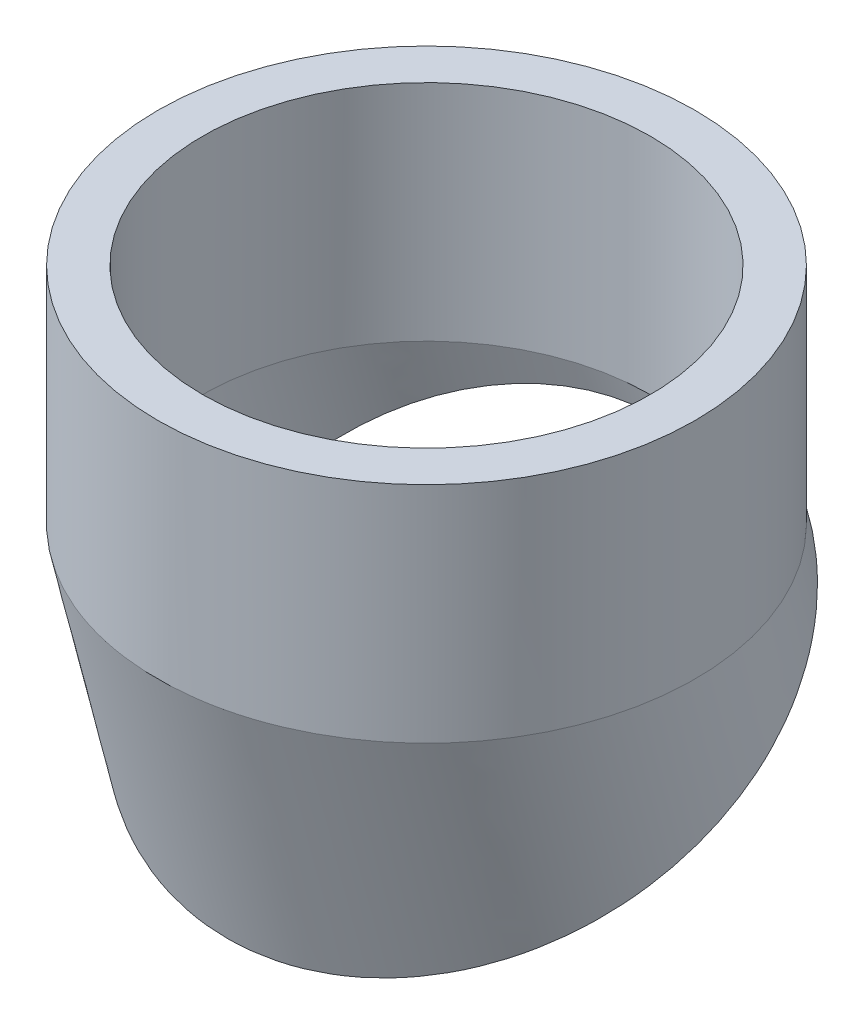
ISO-10303-21;
HEADER;
FILE_DESCRIPTION(('STEP AP214'),'2;1');
FILE_NAME('part.step','',(''),(''),'','','');
FILE_SCHEMA(('AUTOMOTIVE_DESIGN { 1 0 10303 214 1 1 1 1 }'));
ENDSEC;
DATA;
#1=APPLICATION_CONTEXT('core data for automotive mechanical design processes');
#2=APPLICATION_PROTOCOL_DEFINITION('international standard','automotive_design',2000,#1);
#3=PRODUCT_CONTEXT('',#1,'mechanical');
#4=PRODUCT('Part','Part','',(#3));
#5=PRODUCT_RELATED_PRODUCT_CATEGORY('part','',(#4));
#6=PRODUCT_DEFINITION_FORMATION('','',#4);
#7=PRODUCT_DEFINITION_CONTEXT('part definition',#1,'design');
#8=PRODUCT_DEFINITION('design','',#6,#7);
#9=PRODUCT_DEFINITION_SHAPE('','',#8);
#10=(LENGTH_UNIT() NAMED_UNIT(*) SI_UNIT(.MILLI.,.METRE.));
#11=(NAMED_UNIT(*) PLANE_ANGLE_UNIT() SI_UNIT($,.RADIAN.));
#12=(NAMED_UNIT(*) SI_UNIT($,.STERADIAN.) SOLID_ANGLE_UNIT());
#13=UNCERTAINTY_MEASURE_WITH_UNIT(LENGTH_MEASURE(1.E-05),#10,'distance_accuracy_value','');
#14=(GEOMETRIC_REPRESENTATION_CONTEXT(3) GLOBAL_UNCERTAINTY_ASSIGNED_CONTEXT((#13)) GLOBAL_UNIT_ASSIGNED_CONTEXT((#10,
#11,#12)) REPRESENTATION_CONTEXT('',''));
#15=CARTESIAN_POINT('',(0.,0.,0.));
#16=DIRECTION('',(0.,0.,1.));
#17=DIRECTION('',(1.,0.,0.));
#18=AXIS2_PLACEMENT_3D('',#15,#16,#17);
#19=CARTESIAN_POINT('',(0.,5.,0.));
#20=DIRECTION('',(0.,1.,0.));
#21=DIRECTION('',(0.,0.,1.));
#22=AXIS2_PLACEMENT_3D('',#19,#20,#21);
#23=PLANE('',#22);
#24=CARTESIAN_POINT('',(0.,5.,0.));
#25=DIRECTION('',(0.,1.,0.));
#26=DIRECTION('',(0.,0.,1.));
#27=AXIS2_PLACEMENT_3D('',#24,#25,#26);
#28=CIRCLE('',#27,6.);
#29=CARTESIAN_POINT('',(0.,5.,6.));
#30=VERTEX_POINT('',#29);
#31=EDGE_CURVE('E11',#30,#30,#28,.T.);
#32=ORIENTED_EDGE('',*,*,#31,.T.);
#33=EDGE_LOOP('',(#32));
#34=FACE_BOUND('',#33,.T.);
#35=CARTESIAN_POINT('',(0.,5.,0.));
#36=DIRECTION('',(0.,1.,0.));
#37=DIRECTION('',(0.,0.,1.));
#38=AXIS2_PLACEMENT_3D('',#35,#36,#37);
#39=CIRCLE('',#38,5.);
#40=CARTESIAN_POINT('',(0.,5.,5.));
#41=VERTEX_POINT('',#40);
#42=EDGE_CURVE('E45',#41,#41,#39,.T.);
#43=ORIENTED_EDGE('',*,*,#42,.F.);
#44=EDGE_LOOP('',(#43));
#45=FACE_BOUND('',#44,.T.);
#46=ADVANCED_FACE('F33',(#34,#45),#23,.T.);
#47=CARTESIAN_POINT('',(0.,5.,0.));
#48=DIRECTION('',(0.,-1.,0.));
#49=DIRECTION('',(0.,0.,-1.));
#50=AXIS2_PLACEMENT_3D('',#47,#48,#49);
#51=CYLINDRICAL_SURFACE('',#50,6.);
#52=ORIENTED_EDGE('',*,*,#31,.F.);
#53=EDGE_LOOP('',(#52));
#54=FACE_BOUND('',#53,.T.);
#55=CARTESIAN_POINT('',(0.,0.,0.));
#56=DIRECTION('',(0.,-1.,0.));
#57=DIRECTION('',(0.,0.,-1.));
#58=AXIS2_PLACEMENT_3D('',#55,#56,#57);
#59=CIRCLE('',#58,6.);
#60=CARTESIAN_POINT('',(0.,0.,-6.));
#61=VERTEX_POINT('',#60);
#62=EDGE_CURVE('E55',#61,#61,#59,.T.);
#63=ORIENTED_EDGE('',*,*,#62,.F.);
#64=EDGE_LOOP('',(#63));
#65=FACE_BOUND('',#64,.T.);
#66=ADVANCED_FACE('F35',(#54,#65),#51,.T.);
#67=CARTESIAN_POINT('',(0.,5.,0.));
#68=DIRECTION('',(0.,-1.,0.));
#69=DIRECTION('',(0.,0.,-1.));
#70=AXIS2_PLACEMENT_3D('',#67,#68,#69);
#71=CYLINDRICAL_SURFACE('',#70,5.);
#72=ORIENTED_EDGE('',*,*,#42,.T.);
#73=EDGE_LOOP('',(#72));
#74=FACE_BOUND('',#73,.T.);
#75=CARTESIAN_POINT('',(0.,0.,0.));
#76=DIRECTION('',(0.,1.,0.));
#77=DIRECTION('',(0.,0.,1.));
#78=AXIS2_PLACEMENT_3D('',#75,#76,#77);
#79=CIRCLE('',#78,5.);
#80=CARTESIAN_POINT('',(0.,0.,-5.));
#81=VERTEX_POINT('',#80);
#82=EDGE_CURVE('E57',#81,#81,#79,.T.);
#83=ORIENTED_EDGE('',*,*,#82,.F.);
#84=EDGE_LOOP('',(#83));
#85=FACE_BOUND('',#84,.T.);
#86=ADVANCED_FACE('F77',(#74,#85),#71,.F.);
#87=CARTESIAN_POINT('',(0.,0.,-6.));
#88=CARTESIAN_POINT('',(0.,-5.79555495773441,-7.55291427061511));
#89=CARTESIAN_POINT('',(12.,0.,-6.));
#90=CARTESIAN_POINT('',(12.,-5.79555495773441,-7.55291427061511));
#91=CARTESIAN_POINT('',(12.,0.,6.));
#92=CARTESIAN_POINT('',(12.,-5.79555495773441,4.44708572938489));
#93=CARTESIAN_POINT('',(0.,0.,6.));
#94=CARTESIAN_POINT('',(0.,-5.79555495773441,4.44708572938489));
#95=CARTESIAN_POINT('',(-12.,0.,6.));
#96=CARTESIAN_POINT('',(-12.,-5.79555495773441,4.4470857293849));
#97=CARTESIAN_POINT('',(-12.,0.,-6.));
#98=CARTESIAN_POINT('',(-12.,-5.79555495773441,-7.55291427061511));
#99=CARTESIAN_POINT('',(0.,0.,-6.));
#100=CARTESIAN_POINT('',(0.,-5.79555495773441,-7.55291427061511));
#101=(BOUNDED_SURFACE() B_SPLINE_SURFACE(3,1,((#87,#88),(#89,#90),(#91,#92),(#93,#94),(#95,#96),
(#97,#98),(#99,#100)),.UNSPECIFIED.,.T.,.F.,.F.) B_SPLINE_SURFACE_WITH_KNOTS((4,3,4),(2,2),(0.,
0.5,1.),(0.,1.),.UNSPECIFIED.) GEOMETRIC_REPRESENTATION_ITEM() RATIONAL_B_SPLINE_SURFACE(((1.,
1.),(0.333333333333333,0.333333333333333),(0.333333333333333,0.333333333333333),(1.,1.),
(0.333333333333333,0.333333333333333),(0.333333333333333,0.333333333333333),(1.,1.))) REPRESENTATION_ITEM('') SURFACE());
#102=CARTESIAN_POINT('',(0.,0.,-6.));
#103=CARTESIAN_POINT('',(0.169147526803552,5.74547118790013E-07,-6.00000103568046));
#104=CARTESIAN_POINT('',(0.338275211198642,-0.00345586515310282,-5.99377044652549));
#105=CARTESIAN_POINT('',(0.675387230129869,-0.0172582344248159,-5.96889025194503));
#106=CARTESIAN_POINT('',(0.843371252382445,-0.0276059750455709,-5.95023738191639));
#107=CARTESIAN_POINT('',(1.1770951867048,-0.0551343155472903,-5.90061470810749));
#108=CARTESIAN_POINT('',(1.34283295676047,-0.0723210198066483,-5.86963390055541));
#109=CARTESIAN_POINT('',(1.67079471678265,-0.113415475396661,-5.79555690470563));
#110=CARTESIAN_POINT('',(1.83301740187003,-0.137325678116261,-5.75245629752645));
#111=CARTESIAN_POINT('',(2.15260776262663,-0.191678074888071,-5.65448049489605));
#112=CARTESIAN_POINT('',(2.30997898114651,-0.222115366688298,-5.59961413625978));
#113=CARTESIAN_POINT('',(2.61892587369064,-0.289333178122327,-5.47844709639662));
#114=CARTESIAN_POINT('',(2.77049938802334,-0.326116033950413,-5.41214220393852));
#115=CARTESIAN_POINT('',(3.06660914798326,-0.40573540607556,-5.26862007148058));
#116=CARTESIAN_POINT('',(3.21114971919629,-0.448568136489759,-5.19140965592519));
#117=CARTESIAN_POINT('',(3.49230661313792,-0.540021422064853,-5.02655567358794));
#118=CARTESIAN_POINT('',(3.62891999922902,-0.588644102018312,-4.93890827664827));
#119=CARTESIAN_POINT('',(3.89286433464505,-0.691200887465164,-4.75403909026198));
#120=CARTESIAN_POINT('',(4.02021645986562,-0.745122167793634,-4.65684041949828));
#121=CARTESIAN_POINT('',(4.26511824450285,-0.858013451520544,-4.45334223376865));
#122=CARTESIAN_POINT('',(4.38266426245032,-0.916985314108268,-4.34703936742221));
#123=CARTESIAN_POINT('',(4.60700814023009,-1.03952208144375,-4.12615420237912));
#124=CARTESIAN_POINT('',(4.71380970605702,-1.10308538941598,-4.01157478203509));
#125=CARTESIAN_POINT('',(4.91596951250289,-1.23439601501857,-3.77487383228072));
#126=CARTESIAN_POINT('',(5.01132352733212,-1.30214486382203,-3.6527495427729));
#127=CARTESIAN_POINT('',(5.18943349660131,-1.44100207676834,-3.4024450907622));
#128=CARTESIAN_POINT('',(5.27224525874339,-1.51209359627195,-3.2742952924594));
#129=CARTESIAN_POINT('',(5.42521709783853,-1.6574441007541,-3.01228601255292));
#130=CARTESIAN_POINT('',(5.49537249695712,-1.73170424437874,-2.87842444237012));
#131=CARTESIAN_POINT('',(5.6224549953341,-1.88280859981678,-2.60604325250012));
#132=CARTESIAN_POINT('',(5.6793872628943,-1.95965178855031,-2.46752547701996));
#133=CARTESIAN_POINT('',(5.77966007438309,-2.11542724427127,-2.1867241469801));
#134=CARTESIAN_POINT('',(5.82299560513153,-2.19436027018705,-2.04443922437378));
#135=CARTESIAN_POINT('',(5.8955686448199,-2.35338706570789,-1.75777701890915));
#136=CARTESIAN_POINT('',(5.9248658933356,-2.433474395449,-1.61341134457001));
#137=CARTESIAN_POINT('',(5.96944099684847,-2.5945700324696,-1.32301983886302));
#138=CARTESIAN_POINT('',(5.98471368297966,-2.6755786681768,-1.17699341547036));
#139=CARTESIAN_POINT('',(6.00923978967341,-2.91905762848235,-0.738097470187508));
#140=CARTESIAN_POINT('',(5.99728107680768,-3.08215662786249,-0.444094697143774));
#141=CARTESIAN_POINT('',(5.91705633965829,-3.40465369848462,0.137239544155862));
#142=CARTESIAN_POINT('',(5.84889839627453,-3.56405827026518,0.424582730303198));
#143=CARTESIAN_POINT('',(5.65843236045915,-3.87508546333219,0.985241333980938));
#144=CARTESIAN_POINT('',(5.53612417319976,-4.02670807099036,1.25855672694497));
#145=CARTESIAN_POINT('',(5.24075315180589,-4.31799977567147,1.78364007672857));
#146=CARTESIAN_POINT('',(5.06764377332963,-4.45765775836669,2.03538799882581));
#147=CARTESIAN_POINT('',(4.67570128572823,-4.720955951953,2.51001015681559));
#148=CARTESIAN_POINT('',(4.45686749791336,-4.8445959250438,2.73288396404861));
#149=CARTESIAN_POINT('',(3.9789245734007,-5.07279818144169,3.14424207446497));
#150=CARTESIAN_POINT('',(3.7196831173055,-5.17729524241619,3.33260880766495));
#151=CARTESIAN_POINT('',(3.16884660060102,-5.3638012561335,3.66880513891538));
#152=CARTESIAN_POINT('',(2.8772507877573,-5.4458096858647,3.81663379418344));
#153=CARTESIAN_POINT('',(2.2686339435352,-5.58538118553133,4.06822582169931));
#154=CARTESIAN_POINT('',(1.95150867332067,-5.64283729258296,4.1717963823139));
#155=CARTESIAN_POINT('',(1.30191345628726,-5.73120575994449,4.33108966156548));
#156=CARTESIAN_POINT('',(0.969443186101265,-5.7621175606135,4.38681137139205));
#157=CARTESIAN_POINT('',(0.297383042822747,-5.79660679564991,4.44898177574399));
#158=CARTESIAN_POINT('',(-0.0422272183951424,-5.80009079500989,4.45526204402895));
#159=CARTESIAN_POINT('',(-0.717845473926186,-5.77938190592072,4.41793213494301));
#160=CARTESIAN_POINT('',(-1.05385343234601,-5.75518874195468,4.37432146092446));
#161=CARTESIAN_POINT('',(-1.71307255436295,-5.67975440150193,4.238343279819));
#162=CARTESIAN_POINT('',(-2.03627048092415,-5.62848599229154,4.14592668293809));
#163=CARTESIAN_POINT('',(-2.66028880475485,-5.50030774703327,3.91487217191698));
#164=CARTESIAN_POINT('',(-2.96110933847185,-5.42339806735026,3.77623453964061));
#165=CARTESIAN_POINT('',(-3.53121107639788,-5.24625000403569,3.45690687943578));
#166=CARTESIAN_POINT('',(-3.80054935481519,-5.14605485239141,3.27629478162457));
#167=CARTESIAN_POINT('',(-4.30055726035171,-4.92507428565861,2.87795451187963));
#168=CARTESIAN_POINT('',(-4.53122762503301,-4.80428926339545,2.6602270480541));
#169=CARTESIAN_POINT('',(-4.94638190739695,-4.54604726281992,2.19471919960554));
#170=CARTESIAN_POINT('',(-5.13104192540428,-4.40865693662061,1.94705896229266));
#171=CARTESIAN_POINT('',(-5.44995623544266,-4.12076153711964,1.42809780298758));
#172=CARTESIAN_POINT('',(-5.58421180420704,-3.97025679612215,1.15679748000792));
#173=CARTESIAN_POINT('',(-5.79794299926019,-3.66097377097771,0.5992829189536));
#174=CARTESIAN_POINT('',(-5.8776473876444,-3.5022330781608,0.313136443129581));
#175=CARTESIAN_POINT('',(-5.95504724615457,-3.26110340177524,-0.121524675515666));
#176=CARTESIAN_POINT('',(-5.97381982887524,-3.1801799208303,-0.267397598664075));
#177=CARTESIAN_POINT('',(-5.99720757389164,-3.0178610872195,-0.559994042420121));
#178=CARTESIAN_POINT('',(-6.00182799172142,-2.93646592097138,-0.706717226990545));
#179=CARTESIAN_POINT('',(-5.99687777515699,-2.77397238888801,-0.999628582766738));
#180=CARTESIAN_POINT('',(-5.98734010459436,-2.69287377295251,-1.14581720480404));
#181=CARTESIAN_POINT('',(-5.95421521132986,-2.53138349040852,-1.43692009978187));
#182=CARTESIAN_POINT('',(-5.93063319634849,-2.45099157295933,-1.58183482488867));
#183=CARTESIAN_POINT('',(-5.86958326277667,-2.29142828104514,-1.86946412045178));
#184=CARTESIAN_POINT('',(-5.83211027409477,-2.21225736323853,-2.01217786773423));
#185=CARTESIAN_POINT('',(-5.74356921448484,-2.05575649247906,-2.29428683322089));
#186=CARTESIAN_POINT('',(-5.69250613620861,-1.9784258747899,-2.43368324968086));
#187=CARTESIAN_POINT('',(-5.57712638347989,-1.82609241222058,-2.70828003195999));
#188=CARTESIAN_POINT('',(-5.51280439874134,-1.75109051390039,-2.84347869150716));
#189=CARTESIAN_POINT('',(-5.37141181924158,-1.60400370089705,-3.10861784665522));
#190=CARTESIAN_POINT('',(-5.2943458995552,-1.53191772854034,-3.23856024882183));
#191=CARTESIAN_POINT('',(-5.12797766572523,-1.39111724037082,-3.49236765490693));
#192=CARTESIAN_POINT('',(-5.03867128366287,-1.32240385573633,-3.6162306197598));
#193=CARTESIAN_POINT('',(-4.84851944419054,-1.18888044070255,-3.85692035075381));
#194=CARTESIAN_POINT('',(-4.74767819218666,-1.12406900079487,-3.97374965767925));
#195=CARTESIAN_POINT('',(-4.53483719457048,-0.998588459896608,-4.19994127827364));
#196=CARTESIAN_POINT('',(-4.42280523447993,-0.937932217598307,-4.30928041282313));
#197=CARTESIAN_POINT('',(-4.18868052139445,-0.821418916210102,-4.51930765906497));
#198=CARTESIAN_POINT('',(-4.06659143202161,-0.765560124513427,-4.61999889395978));
#199=CARTESIAN_POINT('',(-3.8131089702063,-0.658971770703913,-4.81213539825019));
#200=CARTESIAN_POINT('',(-3.68170980148464,-0.608245452538097,-4.9035748200966));
#201=CARTESIAN_POINT('',(-3.41065988514598,-0.512330981243246,-5.07647054994705));
#202=CARTESIAN_POINT('',(-3.27101214057069,-0.467140830769048,-5.15793045837182));
#203=CARTESIAN_POINT('',(-2.98368569447824,-0.382375023992501,-5.31072957023828));
#204=CARTESIAN_POINT('',(-2.83596998730473,-0.342828883150925,-5.38201556901686));
#205=CARTESIAN_POINT('',(-2.5342660342027,-0.26991144416484,-5.513456775564));
#206=CARTESIAN_POINT('',(-2.38028005831609,-0.236537935155332,-5.5736159686448));
#207=CARTESIAN_POINT('',(-2.06721051247778,-0.176204629796304,-5.68237297604437));
#208=CARTESIAN_POINT('',(-1.90813148273018,-0.149239292109717,-5.73098077919489));
#209=CARTESIAN_POINT('',(-1.58592739551983,-0.101877178848918,-5.8163558746204));
#210=CARTESIAN_POINT('',(-1.42280339438827,-0.0814787074160449,-5.85312622385559));
#211=CARTESIAN_POINT('',(-1.05161076012539,-0.0430322649986809,-5.92242990277042));
#212=CARTESIAN_POINT('',(-0.84268346461728,-0.0269084413354735,-5.95149475839226));
#213=CARTESIAN_POINT('',(-0.422493802053899,-0.00539265355413998,-5.99027918561728));
#214=CARTESIAN_POINT('',(-0.211231428895042,-7.17494434166084E-07,-5.99999870664226));
#215=CARTESIAN_POINT('',(0.,0.,-6.));
#216=B_SPLINE_CURVE_WITH_KNOTS('',3,(#102,#103,#104,#105,#106,#107,#108,#109,#110,#111,#112,
#113,#114,#115,#116,#117,#118,#119,#120,#121,#122,#123,#124,#125,#126,#127,#128,#129,#130,#131,
#132,#133,#134,#135,#136,#137,#138,#139,#140,#141,#142,#143,#144,#145,#146,#147,#148,#149,#150,
#151,#152,#153,#154,#155,#156,#157,#158,#159,#160,#161,#162,#163,#164,#165,#166,#167,#168,#169,
#170,#171,#172,#173,#174,#175,#176,#177,#178,#179,#180,#181,#182,#183,#184,#185,#186,#187,#188,
#189,#190,#191,#192,#193,#194,#195,#196,#197,#198,#199,#200,#201,#202,#203,#204,#205,#206,#207,
#208,#209,#210,#211,#212,#213,#214,#215),.UNSPECIFIED.,.T.,.F.,(4,2,2,2,2,2,2,2,2,2,2,2,2,2,2,2,
2,2,2,2,2,2,2,2,2,2,2,2,2,2,2,2,2,2,2,2,2,2,2,2,2,2,2,2,2,2,2,2,2,2,2,2,2,2,2,2,4),(0.,
0.507258488614138,1.01465033852459,1.5224960999845,2.03052726273043,2.53817819039455,
3.04601641615949,3.55353824406474,4.06124689939603,4.56775558550935,5.07445153255805,
5.58097210561346,6.0876790862644,6.59206064785917,7.09662825034727,7.60099830790463,
8.10555411110955,8.60794328885335,9.11051755196621,10.114567988497,11.1166919528039,
12.118817672035,13.1218644264728,14.1249260702422,15.1313441671238,16.1377856679962,
17.1485681322702,18.1593719066245,19.1736175815156,20.1878733529709,21.2031512278575,
22.2184229115181,23.2318244835347,24.2452067234595,25.2546486054874,26.2640649168546,
27.269221837318,27.7723354071096,28.2752621184732,28.7770197164922,29.2785913757628,
29.7803462851184,30.2819171163742,30.7836892219764,31.285277660665,31.7870332001421,
32.2886063881503,32.7916675035793,33.2945461669482,33.7977407117236,34.3007531753686,
34.8063066642164,35.3116787257206,35.816612173663,36.3214151204025,36.9548778570747,
37.5883422499271),.UNSPECIFIED.);
#217=EDGE_CURVE('E50',#61,#61,#216,.T.);
#218=ORIENTED_EDGE('',*,*,#217,.F.);
#219=ORIENTED_EDGE('',*,*,#62,.T.);
#220=EDGE_LOOP('',(#218,#219));
#221=FACE_BOUND('',#220,.T.);
#222=ADVANCED_FACE('F63',(#221),#101,.T.);
#223=CARTESIAN_POINT('',(0.,0.,-5.));
#224=CARTESIAN_POINT('',(0.,-5.79555495773441,-6.55291427061511));
#225=CARTESIAN_POINT('',(-10.,0.,-5.));
#226=CARTESIAN_POINT('',(-10.,-5.79555495773441,-6.55291427061511));
#227=CARTESIAN_POINT('',(-10.,0.,5.));
#228=CARTESIAN_POINT('',(-10.,-5.79555495773441,3.44708572938489));
#229=CARTESIAN_POINT('',(0.,0.,5.));
#230=CARTESIAN_POINT('',(0.,-5.79555495773441,3.44708572938489));
#231=CARTESIAN_POINT('',(10.,0.,5.));
#232=CARTESIAN_POINT('',(10.,-5.79555495773441,3.44708572938489));
#233=CARTESIAN_POINT('',(10.,0.,-5.));
#234=CARTESIAN_POINT('',(10.,-5.79555495773441,-6.55291427061511));
#235=CARTESIAN_POINT('',(0.,0.,-5.));
#236=CARTESIAN_POINT('',(0.,-5.79555495773441,-6.55291427061511));
#237=(BOUNDED_SURFACE() B_SPLINE_SURFACE(3,1,((#223,#224),(#225,#226),(#227,#228),(#229,#230),
(#231,#232),(#233,#234),(#235,#236)),.UNSPECIFIED.,.T.,.F.,.F.) B_SPLINE_SURFACE_WITH_KNOTS((4,
3,4),(2,2),(0.,0.5,1.),(0.,1.),
.UNSPECIFIED.) GEOMETRIC_REPRESENTATION_ITEM() RATIONAL_B_SPLINE_SURFACE(((1.,1.),
(0.333333333333333,0.333333333333333),(0.333333333333333,0.333333333333333),(1.,1.),
(0.333333333333333,0.333333333333333),(0.333333333333333,0.333333333333333),(1.,1.))) REPRESENTATION_ITEM('') SURFACE());
#238=CARTESIAN_POINT('',(0.,-0.482962913144534,-5.12940952255126));
#239=CARTESIAN_POINT('',(-0.138969160024831,-0.482963639261778,-5.12940821365001));
#240=CARTESIAN_POINT('',(-0.277976162801513,-0.485763722509706,-5.12436077471555));
#241=CARTESIAN_POINT('',(-0.555094496994169,-0.49695025725615,-5.10419589173831));
#242=CARTESIAN_POINT('',(-0.693205245122361,-0.505340037709665,-5.08907244691072));
#243=CARTESIAN_POINT('',(-0.969361236918727,-0.527801995801903,-5.04858245008542));
#244=CARTESIAN_POINT('',(-1.10738076084965,-0.541948873093602,-5.0230812442566));
#245=CARTESIAN_POINT('',(-1.38052650850591,-0.575833705494605,-4.96200033801022));
#246=CARTESIAN_POINT('',(-1.51565160171889,-0.595573803879144,-4.92641677411794));
#247=CARTESIAN_POINT('',(-1.78211060058536,-0.640525668138302,-4.84538640117939));
#248=CARTESIAN_POINT('',(-1.91344109030391,-0.665742200115826,-4.79993100074092));
#249=CARTESIAN_POINT('',(-2.17129528214418,-0.721471607025783,-4.69947299527259));
#250=CARTESIAN_POINT('',(-2.2978171877586,-0.751986438170991,-4.64446686396738));
#251=CARTESIAN_POINT('',(-2.54493736993052,-0.818050716106917,-4.52537918724274));
#252=CARTESIAN_POINT('',(-2.66554295443265,-0.853593729752784,-4.46130923823061));
#253=CARTESIAN_POINT('',(-2.90017821912436,-0.929508722456568,-4.32446463185454));
#254=CARTESIAN_POINT('',(-3.01420545071457,-0.969882482648059,-4.25168676381358));
#255=CARTESIAN_POINT('',(-3.23473889672135,-1.05513629950417,-4.0980079634315));
#256=CARTESIAN_POINT('',(-3.34125001025815,-1.10001337375525,-4.01711240719846));
#257=CARTESIAN_POINT('',(-3.54609950474679,-1.1939966245354,-3.84769790156666));
#258=CARTESIAN_POINT('',(-3.64443486421431,-1.24310435103964,-3.75917615817774));
#259=CARTESIAN_POINT('',(-3.83180967682264,-1.34498892962178,-3.57551869401559));
#260=CARTESIAN_POINT('',(-3.92088355355437,-1.39775088408332,-3.48040982773281));
#261=CARTESIAN_POINT('',(-4.08955148758709,-1.50675844707243,-3.28391244931027));
#262=CARTESIAN_POINT('',(-4.16914203259016,-1.56300533464788,-3.18252163155474));
#263=CARTESIAN_POINT('',(-4.31819871593246,-1.67854570377035,-2.97424819609774));
#264=CARTESIAN_POINT('',(-4.38766827397223,-1.73783814707707,-2.86736744993152));
#265=CARTESIAN_POINT('',(-4.51603016246604,-1.85908660850236,-2.64880458920399));
#266=CARTESIAN_POINT('',(-4.57491859017773,-1.92104359901233,-2.53712072180687));
#267=CARTESIAN_POINT('',(-4.68140222225814,-2.04686039658647,-2.31032296386316));
#268=CARTESIAN_POINT('',(-4.72904923460581,-2.11070988468405,-2.19522767431845));
#269=CARTESIAN_POINT('',(-4.81307281738246,-2.2401556035437,-1.96188841136765));
#270=CARTESIAN_POINT('',(-4.84944522716474,-2.30575246946334,-1.84364329302452));
#271=CARTESIAN_POINT('',(-4.91061500569194,-2.4381820173464,-1.60492537042218));
#272=CARTESIAN_POINT('',(-4.93541691443189,-2.50501420387942,-1.4844534592274));
#273=CARTESIAN_POINT('',(-4.97329892015236,-2.63946258398607,-1.24209638326237));
#274=CARTESIAN_POINT('',(-4.98637469335509,-2.70707905744871,-1.12021071396331));
#275=CARTESIAN_POINT('',(-5.00775164041702,-2.90990742760434,-0.754591651281589));
#276=CARTESIAN_POINT('',(-4.99846028869658,-3.04565947076049,-0.509884588173032));
#277=CARTESIAN_POINT('',(-4.93299559167879,-3.31440126929285,-0.0254497706600342));
#278=CARTESIAN_POINT('',(-4.87682262370956,-3.44739104689241,0.214278023804286));
#279=CARTESIAN_POINT('',(-4.71930425275471,-3.70685705033457,0.681992263698361));
#280=CARTESIAN_POINT('',(-4.61798363994299,-3.83333680831419,0.909985076169501));
#281=CARTESIAN_POINT('',(-4.3731029764392,-4.07626998253454,1.34789718572592));
#282=CARTESIAN_POINT('',(-4.22954253953128,-4.19272330708695,1.55781631753353));
#283=CARTESIAN_POINT('',(-3.90394657990859,-4.41259495160069,1.9541576405729));
#284=CARTESIAN_POINT('',(-3.72182549009109,-4.51598345183943,2.14052607867827));
#285=CARTESIAN_POINT('',(-3.32451800494707,-4.70653433666614,2.48401370740622));
#286=CARTESIAN_POINT('',(-3.10933095149019,-4.79369639821384,2.64113231571541));
#287=CARTESIAN_POINT('',(-2.65107286261,-4.94970001661903,2.92234493253277));
#288=CARTESIAN_POINT('',(-2.40789244005197,-5.01846595550008,3.04630263183703));
#289=CARTESIAN_POINT('',(-1.90125772129336,-5.13531017464133,3.25692639146893));
#290=CARTESIAN_POINT('',(-1.63780294777271,-5.18338796766371,3.34359157350012));
#291=CARTESIAN_POINT('',(-1.09693938796011,-5.25768745110602,3.47752405776291));
#292=CARTESIAN_POINT('',(-0.819477883497257,-5.28381884519036,3.52462859153386));
#293=CARTESIAN_POINT('',(-0.259450428630475,-5.31317243105177,3.57754145841126));
#294=CARTESIAN_POINT('',(0.0231156059133309,-5.31639424485561,3.58334911018197));
#295=CARTESIAN_POINT('',(0.586034420711601,-5.29982102607129,3.55347417349094));
#296=CARTESIAN_POINT('',(0.866380417022104,-5.27997174097426,3.51769378928481));
#297=CARTESIAN_POINT('',(1.41622835323513,-5.21771016894544,3.40546088227681));
#298=CARTESIAN_POINT('',(1.68573026785224,-5.17529782940612,3.32900826464442));
#299=CARTESIAN_POINT('',(2.20606055547655,-5.06912851235291,3.1376271173386));
#300=CARTESIAN_POINT('',(2.45689671979052,-5.00538050238553,3.0227147525929));
#301=CARTESIAN_POINT('',(2.93295853263526,-4.85824364445811,2.75748538630613));
#302=CARTESIAN_POINT('',(3.15818452931469,-4.77485506354244,2.60716886614008));
#303=CARTESIAN_POINT('',(3.47135837356438,-4.6370904911829,2.35883401151302));
#304=CARTESIAN_POINT('',(3.57155320071436,-4.58910821936045,2.27234101629936));
#305=CARTESIAN_POINT('',(3.76321828092947,-4.48921381237654,2.09227104176582));
#306=CARTESIAN_POINT('',(3.85469179740431,-4.43730316031356,1.99869673588395));
#307=CARTESIAN_POINT('',(4.02827965066061,-4.32989717665146,1.8050863694307));
#308=CARTESIAN_POINT('',(4.11039063321452,-4.27440057143247,1.70504801302811));
#309=CARTESIAN_POINT('',(4.26459793438557,-4.16025247162171,1.49928428664364));
#310=CARTESIAN_POINT('',(4.33669800534233,-4.10160217061143,1.39356106821555));
#311=CARTESIAN_POINT('',(4.47012540657892,-3.98178341810487,1.17757540531479));
#312=CARTESIAN_POINT('',(4.53149391777366,-3.92062575641938,1.06733241058926));
#313=CARTESIAN_POINT('',(4.64333488755197,-3.79603622419582,0.842746925054971));
#314=CARTESIAN_POINT('',(4.69381143091539,-3.73260521666663,0.72840598990875));
#315=CARTESIAN_POINT('',(4.78354359548069,-3.60387708473858,0.496360251434441));
#316=CARTESIAN_POINT('',(4.82279524557116,-3.53857930888386,0.378654273789968));
#317=CARTESIAN_POINT('',(4.8897529706688,-3.40663101515508,0.140803861450938));
#318=CARTESIAN_POINT('',(4.91746335196055,-3.33998101157704,0.0206603538280127));
#319=CARTESIAN_POINT('',(4.96108356536013,-3.20600429697443,-0.220846496405006));
#320=CARTESIAN_POINT('',(4.97703209116625,-3.13868055006106,-0.342204495898862));
#321=CARTESIAN_POINT('',(4.99715785568228,-3.00364544757494,-0.585619199484085));
#322=CARTESIAN_POINT('',(5.00133948022229,-2.93593424584857,-0.707675626251471));
#323=CARTESIAN_POINT('',(4.99791271393948,-2.8005577634276,-0.951705702388878));
#324=CARTESIAN_POINT('',(4.99030009054367,-2.73289250794067,-1.07367930631946));
#325=CARTESIAN_POINT('',(4.96333770183217,-2.59813981677339,-1.31658493436655));
#326=CARTESIAN_POINT('',(4.94399227048842,-2.53105217700413,-1.43751732637436));
#327=CARTESIAN_POINT('',(4.89373648161565,-2.39797888049099,-1.67739567229693));
#328=CARTESIAN_POINT('',(4.86283859290852,-2.33199211547432,-1.79634362398772));
#329=CARTESIAN_POINT('',(4.78971431673875,-2.20153885631877,-2.03149908226818));
#330=CARTESIAN_POINT('',(4.74749210476268,-2.13707181134334,-2.14770758179758));
#331=CARTESIAN_POINT('',(4.65200225639149,-2.01006444635634,-2.37665146033189));
#332=CARTESIAN_POINT('',(4.59873038777221,-1.94752487517616,-2.48938548949098));
#333=CARTESIAN_POINT('',(4.48155876455834,-1.82486224272847,-2.71049753938412));
#334=CARTESIAN_POINT('',(4.41766288513704,-1.7647383102344,-2.81887713059393));
#335=CARTESIAN_POINT('',(4.27956778544427,-1.64720121390228,-3.03074987284547));
#336=CARTESIAN_POINT('',(4.20535052926221,-1.58979303624814,-3.13423403577625));
#337=CARTESIAN_POINT('',(4.04725506256219,-1.478218406591,-3.33535881670806));
#338=CARTESIAN_POINT('',(3.96337905191519,-1.42405122067606,-3.43300075766104));
#339=CARTESIAN_POINT('',(3.78658575404431,-1.31934451128023,-3.62174540376957));
#340=CARTESIAN_POINT('',(3.69367267264675,-1.26880331912278,-3.71285111688675));
#341=CARTESIAN_POINT('',(3.4993820027378,-1.17163763629977,-3.88800228460219));
#342=CARTESIAN_POINT('',(3.39799644700649,-1.12501691685521,-3.97204094118553));
#343=CARTESIAN_POINT('',(3.08163053613235,-0.991322072186527,-4.21303969178258));
#344=CARTESIAN_POINT('',(2.85486511811996,-0.910666055177733,-4.35843048359228));
#345=CARTESIAN_POINT('',(2.37671434166493,-0.768906325859167,-4.61396702081187));
#346=CARTESIAN_POINT('',(2.12532921286555,-0.707802431197342,-4.72411309493015));
#347=CARTESIAN_POINT('',(1.73462560043396,-0.631913256988485,-4.86091116080549));
#348=CARTESIAN_POINT('',(1.60164623275375,-0.609194759724649,-4.90186359595434));
#349=CARTESIAN_POINT('',(1.33229114841014,-0.569274873407972,-4.97382330951052));
#350=CARTESIAN_POINT('',(1.19591817966528,-0.552069167669105,-5.00483836918977));
#351=CARTESIAN_POINT('',(0.920948286673028,-0.523307696533313,-5.05668388818667));
#352=CARTESIAN_POINT('',(0.782356049685055,-0.511741320640813,-5.07753347401728));
#353=CARTESIAN_POINT('',(0.503692668676203,-0.494290158326239,-5.1089909944976));
#354=CARTESIAN_POINT('',(0.363622135137024,-0.488403112738058,-5.11960300152731));
#355=CARTESIAN_POINT('',(0.148931342621192,-0.483766025679802,-5.12796182935061));
#356=CARTESIAN_POINT('',(0.0744711049578942,-0.482962524031198,-5.12941022396819));
#357=CARTESIAN_POINT('',(0.,-0.482962913144534,-5.12940952255126));
#358=B_SPLINE_CURVE_WITH_KNOTS('',3,(#238,#239,#240,#241,#242,#243,#244,#245,#246,#247,#248,
#249,#250,#251,#252,#253,#254,#255,#256,#257,#258,#259,#260,#261,#262,#263,#264,#265,#266,#267,
#268,#269,#270,#271,#272,#273,#274,#275,#276,#277,#278,#279,#280,#281,#282,#283,#284,#285,#286,
#287,#288,#289,#290,#291,#292,#293,#294,#295,#296,#297,#298,#299,#300,#301,#302,#303,#304,#305,
#306,#307,#308,#309,#310,#311,#312,#313,#314,#315,#316,#317,#318,#319,#320,#321,#322,#323,#324,
#325,#326,#327,#328,#329,#330,#331,#332,#333,#334,#335,#336,#337,#338,#339,#340,#341,#342,#343,
#344,#345,#346,#347,#348,#349,#350,#351,#352,#353,#354,#355,#356,#357),.UNSPECIFIED.,.T.,.F.,(4,
2,2,2,2,2,2,2,2,2,2,2,2,2,2,2,2,2,2,2,2,2,2,2,2,2,2,2,2,2,2,2,2,2,2,2,2,2,2,2,2,2,2,2,2,2,2,2,2,
2,2,2,2,2,2,2,2,2,2,4),(0.,0.416853193138403,0.833954866182485,1.25665044014772,
1.67950820706016,2.10273546957328,2.52611932761907,2.94896631921892,3.37196970100854,
3.79469476604975,4.21757536802072,4.63882332640009,5.06022681866219,5.48148759434744,
5.90290343025498,6.322337408069,6.74192598509946,7.16134978658746,7.58092817869409,
8.41657430545411,9.25221370655554,10.087394829765,10.9225835896116,11.7596454514462,
12.5967239759495,13.4371922398171,14.2776802969288,15.1216097513782,15.9655531293478,
16.8114850920415,17.657419027101,18.5029978551955,19.3485651869837,19.7705279400475,
20.1923321748877,20.614287053911,21.0360833442692,21.4562237265407,21.8762062700056,
22.2963372104314,22.7163112506306,23.1348974369754,23.5533275846842,23.9719079281851,
24.390333746742,24.8083092466967,25.2261308427525,25.6441127687542,26.0619425664003,
26.4805118886512,26.8989860657096,27.3172664096108,27.7359446140417,28.5752818750969,
29.41461130788,29.8371484508662,30.2593539210205,30.6807619090157,31.1020021970131,
31.3253864204818),.UNSPECIFIED.);
#359=CARTESIAN_POINT('',(0.,-0.482962913144535,-5.12940952255126));
#360=VERTEX_POINT('',#359);
#361=EDGE_CURVE('E37',#360,#360,#358,.T.);
#362=CARTESIAN_POINT('',(0.,-0.482962913144535,-5.12940952255126));
#363=CARTESIAN_POINT('',(0.,-0.477932049465946,-5.12806150669135));
#364=CARTESIAN_POINT('',(0.,-0.472901185787357,-5.12671349083144));
#365=CARTESIAN_POINT('',(0.,-0.46283945843018,-5.12401745911162));
#366=CARTESIAN_POINT('',(0.,-0.457808594751591,-5.12266944325171));
#367=CARTESIAN_POINT('',(0.,-0.447746867394413,-5.1199734115319));
#368=CARTESIAN_POINT('',(0.,-0.442716003715824,-5.11862539567199));
#369=CARTESIAN_POINT('',(0.,-0.432654276358646,-5.11592936395217));
#370=CARTESIAN_POINT('',(0.,-0.427623412680057,-5.11458134809226));
#371=CARTESIAN_POINT('',(0.,-0.417561685322879,-5.11188531637244));
#372=CARTESIAN_POINT('',(0.,-0.41253082164429,-5.11053730051253));
#373=CARTESIAN_POINT('',(0.,-0.402469094287113,-5.10784126879272));
#374=CARTESIAN_POINT('',(0.,-0.397438230608524,-5.10649325293281));
#375=CARTESIAN_POINT('',(0.,-0.387376503251346,-5.10379722121299));
#376=CARTESIAN_POINT('',(0.,-0.382345639572757,-5.10244920535308));
#377=CARTESIAN_POINT('',(0.,-0.372283912215579,-5.09975317363326));
#378=CARTESIAN_POINT('',(0.,-0.36725304853699,-5.09840515777335));
#379=CARTESIAN_POINT('',(0.,-0.357191321179812,-5.09570912605354));
#380=CARTESIAN_POINT('',(0.,-0.352160457501224,-5.09436111019363));
#381=CARTESIAN_POINT('',(0.,-0.342098730144046,-5.09166507847381));
#382=CARTESIAN_POINT('',(0.,-0.337067866465457,-5.0903170626139));
#383=CARTESIAN_POINT('',(0.,-0.327006139108279,-5.08762103089408));
#384=CARTESIAN_POINT('',(0.,-0.32197527542969,-5.08627301503417));
#385=CARTESIAN_POINT('',(0.,-0.311913548072512,-5.08357698331436));
#386=CARTESIAN_POINT('',(0.,-0.306882684393923,-5.08222896745445));
#387=CARTESIAN_POINT('',(0.,-0.296820957036746,-5.07953293573463));
#388=CARTESIAN_POINT('',(0.,-0.291790093358157,-5.07818491987472));
#389=CARTESIAN_POINT('',(0.,-0.281728366000979,-5.0754888881549));
#390=CARTESIAN_POINT('',(0.,-0.27669750232239,-5.07414087229499));
#391=CARTESIAN_POINT('',(0.,-0.266635774965212,-5.07144484057518));
#392=CARTESIAN_POINT('',(0.,-0.261604911286623,-5.07009682471527));
#393=CARTESIAN_POINT('',(0.,-0.251543183929445,-5.06740079299545));
#394=CARTESIAN_POINT('',(0.,-0.246512320250856,-5.06605277713554));
#395=CARTESIAN_POINT('',(0.,-0.236450592893679,-5.06335674541572));
#396=CARTESIAN_POINT('',(0.,-0.23141972921509,-5.06200872955581));
#397=CARTESIAN_POINT('',(0.,-0.221358001857912,-5.05931269783599));
#398=CARTESIAN_POINT('',(0.,-0.216327138179323,-5.05796468197608));
#399=CARTESIAN_POINT('',(0.,-0.206265410822145,-5.05526865025627));
#400=CARTESIAN_POINT('',(0.,-0.201234547143556,-5.05392063439636));
#401=CARTESIAN_POINT('',(0.,-0.191172819786379,-5.05122460267654));
#402=CARTESIAN_POINT('',(0.,-0.18614195610779,-5.04987658681663));
#403=CARTESIAN_POINT('',(0.,-0.176080228750612,-5.04718055509681));
#404=CARTESIAN_POINT('',(0.,-0.171049365072023,-5.0458325392369));
#405=CARTESIAN_POINT('',(0.,-0.160987637714845,-5.04313650751709));
#406=CARTESIAN_POINT('',(0.,-0.155956774036256,-5.04178849165718));
#407=CARTESIAN_POINT('',(0.,-0.145895046679078,-5.03909245993736));
#408=CARTESIAN_POINT('',(0.,-0.140864183000489,-5.03774444407745));
#409=CARTESIAN_POINT('',(0.,-0.130802455643312,-5.03504841235763));
#410=CARTESIAN_POINT('',(0.,-0.125771591964723,-5.03370039649772));
#411=CARTESIAN_POINT('',(0.,-0.115709864607545,-5.03100436477791));
#412=CARTESIAN_POINT('',(0.,-0.110679000928956,-5.029656348918));
#413=CARTESIAN_POINT('',(0.,-0.100617273571778,-5.02696031719818));
#414=CARTESIAN_POINT('',(0.,-0.0955864098931893,-5.02561230133827));
#415=CARTESIAN_POINT('',(0.,-0.0855246825360114,-5.02291626961845));
#416=CARTESIAN_POINT('',(0.,-0.0804938188574225,-5.02156825375854));
#417=CARTESIAN_POINT('',(0.,-0.0704320915002447,-5.01887222203873));
#418=CARTESIAN_POINT('',(0.,-0.0654012278216559,-5.01752420617882));
#419=CARTESIAN_POINT('',(0.,-0.055339500464478,-5.014828174459));
#420=CARTESIAN_POINT('',(0.,-0.0503086367858891,-5.01348015859909));
#421=CARTESIAN_POINT('',(0.,-0.0402469094287113,-5.01078412687927));
#422=CARTESIAN_POINT('',(0.,-0.0352160457501224,-5.00943611101936));
#423=CARTESIAN_POINT('',(0.,-0.0251543183929446,-5.00674007929954));
#424=CARTESIAN_POINT('',(0.,-0.0201234547143556,-5.00539206343964));
#425=CARTESIAN_POINT('',(0.,-0.0100617273571777,-5.00269603171982));
#426=CARTESIAN_POINT('',(0.,-0.00503086367858869,-5.00134801585991));
#427=CARTESIAN_POINT('',(0.,0.,-5.));
#428=B_SPLINE_CURVE_WITH_KNOTS('',3,(#362,#363,#364,#365,#366,#367,#368,#369,#370,#371,#372,
#373,#374,#375,#376,#377,#378,#379,#380,#381,#382,#383,#384,#385,#386,#387,#388,#389,#390,#391,
#392,#393,#394,#395,#396,#397,#398,#399,#400,#401,#402,#403,#404,#405,#406,#407,#408,#409,#410,
#411,#412,#413,#414,#415,#416,#417,#418,#419,#420,#421,#422,#423,#424,#425,#426,#427),
.UNSPECIFIED.,.F.,.F.,(4,2,2,2,2,2,2,2,2,2,2,2,2,2,2,2,2,2,2,2,2,2,2,2,2,2,2,2,2,2,2,2,4),(0.,
0.015625,0.0312499999999999,0.0468750000000001,0.0625000000000001,0.078125,0.0937500000000001,
0.109375,0.125,0.140625,0.15625,0.171875,0.1875,0.203125,0.21875,0.234375,0.25,0.265625,0.28125,
0.296875000000001,0.3125,0.328125,0.343750000000001,0.359375000000001,0.375,0.390625000000001,
0.406250000000001,0.421875000000001,0.437500000000001,0.453125000000001,0.468750000000001,
0.484375000000001,0.500000000000001),.UNSPECIFIED.);
#429=EDGE_CURVE('BSEAM70',#360,#81,#428,.T.);
#430=ORIENTED_EDGE('',*,*,#361,.F.);
#431=ORIENTED_EDGE('',*,*,#82,.T.);
#432=ORIENTED_EDGE('',*,*,#429,.T.);
#433=ORIENTED_EDGE('',*,*,#429,.F.);
#434=EDGE_LOOP('',(#430,#432,#431,#433));
#435=FACE_BOUND('',#434,.T.);
#436=ADVANCED_FACE('F70',(#435),#237,.T.);
#437=CARTESIAN_POINT('',(-10.,-5.79555495773441,4.44708572938489));
#438=DIRECTION('',(0.,0.874454945347851,0.485106739343711));
#439=DIRECTION('',(0.,-0.48510673934371,0.874454945347851));
#440=AXIS2_PLACEMENT_3D('',#437,#438,#439);
#441=PLANE('',#440);
#442=ORIENTED_EDGE('',*,*,#217,.T.);
#443=EDGE_LOOP('',(#442));
#444=FACE_BOUND('',#443,.T.);
#445=ORIENTED_EDGE('',*,*,#361,.T.);
#446=EDGE_LOOP('',(#445));
#447=FACE_BOUND('',#446,.T.);
#448=ADVANCED_FACE('F51',(#444,#447),#441,.F.);
#449=CLOSED_SHELL('',(#46,#66,#86,#222,#436,#448));
#450=MANIFOLD_SOLID_BREP('B2',#449);
#451=ADVANCED_BREP_SHAPE_REPRESENTATION('',(#18,#450),#14);
#452=SHAPE_DEFINITION_REPRESENTATION(#9,#451);
ENDSEC;
END-ISO-10303-21;
